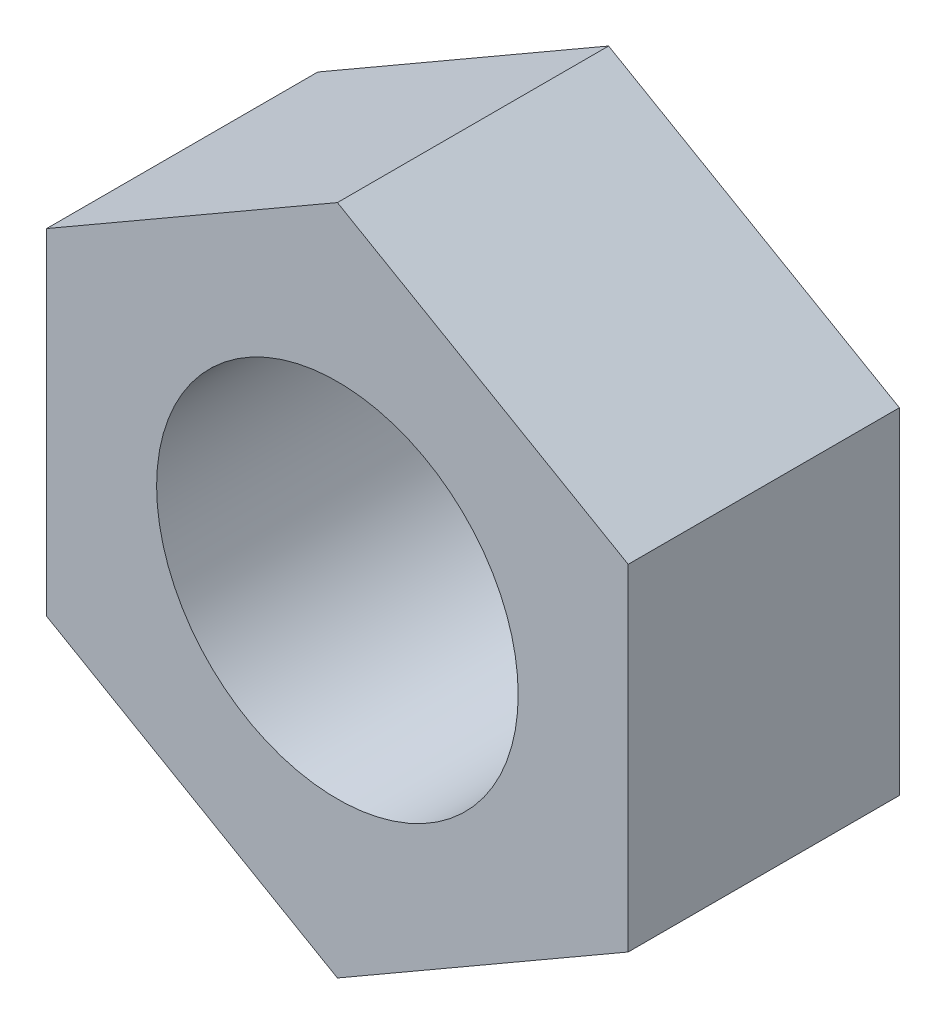
ISO-10303-21;
HEADER;
FILE_DESCRIPTION(('STEP AP214'),'2;1');
FILE_NAME('part.step','',(''),(''),'','','');
FILE_SCHEMA(('AUTOMOTIVE_DESIGN { 1 0 10303 214 1 1 1 1 }'));
ENDSEC;
DATA;
#1=APPLICATION_CONTEXT('core data for automotive mechanical design processes');
#2=APPLICATION_PROTOCOL_DEFINITION('international standard','automotive_design',2000,#1);
#3=PRODUCT_CONTEXT('',#1,'mechanical');
#4=PRODUCT('Part','Part','',(#3));
#5=PRODUCT_RELATED_PRODUCT_CATEGORY('part','',(#4));
#6=PRODUCT_DEFINITION_FORMATION('','',#4);
#7=PRODUCT_DEFINITION_CONTEXT('part definition',#1,'design');
#8=PRODUCT_DEFINITION('design','',#6,#7);
#9=PRODUCT_DEFINITION_SHAPE('','',#8);
#10=(LENGTH_UNIT() NAMED_UNIT(*) SI_UNIT(.MILLI.,.METRE.));
#11=(NAMED_UNIT(*) PLANE_ANGLE_UNIT() SI_UNIT($,.RADIAN.));
#12=(NAMED_UNIT(*) SI_UNIT($,.STERADIAN.) SOLID_ANGLE_UNIT());
#13=UNCERTAINTY_MEASURE_WITH_UNIT(LENGTH_MEASURE(1.E-05),#10,'distance_accuracy_value','');
#14=(GEOMETRIC_REPRESENTATION_CONTEXT(3) GLOBAL_UNCERTAINTY_ASSIGNED_CONTEXT((#13)) GLOBAL_UNIT_ASSIGNED_CONTEXT((#10,
#11,#12)) REPRESENTATION_CONTEXT('',''));
#15=CARTESIAN_POINT('',(0.,0.,0.));
#16=DIRECTION('',(0.,0.,1.));
#17=DIRECTION('',(1.,0.,0.));
#18=AXIS2_PLACEMENT_3D('',#15,#16,#17);
#19=CARTESIAN_POINT('',(0.,0.,4.5));
#20=DIRECTION('',(0.,0.,1.));
#21=DIRECTION('',(1.,0.,0.));
#22=AXIS2_PLACEMENT_3D('',#19,#20,#21);
#23=PLANE('',#22);
#24=DIRECTION('',(-0.866025403784439,0.5,0.));
#25=VECTOR('',#24,1.);
#26=CARTESIAN_POINT('',(9.65,5.57143009767989,4.5));
#27=LINE('',#26,#25);
#28=CARTESIAN_POINT('',(9.65,5.57143009767989,4.5));
#29=VERTEX_POINT('',#28);
#30=CARTESIAN_POINT('',(0.,11.1428601953598,4.5));
#31=VERTEX_POINT('',#30);
#32=EDGE_CURVE('E129',#29,#31,#27,.T.);
#33=ORIENTED_EDGE('',*,*,#32,.T.);
#34=DIRECTION('',(-0.866025403784439,-0.5,0.));
#35=VECTOR('',#34,1.);
#36=CARTESIAN_POINT('',(0.,11.1428601953598,4.5));
#37=LINE('',#36,#35);
#38=CARTESIAN_POINT('',(-9.65,5.57143009767988,4.5));
#39=VERTEX_POINT('',#38);
#40=EDGE_CURVE('E87',#31,#39,#37,.T.);
#41=ORIENTED_EDGE('',*,*,#40,.T.);
#42=DIRECTION('',(0.,-1.,0.));
#43=VECTOR('',#42,1.);
#44=CARTESIAN_POINT('',(-9.65,5.57143009767988,4.5));
#45=LINE('',#44,#43);
#46=CARTESIAN_POINT('',(-9.65,-5.57143009767989,4.5));
#47=VERTEX_POINT('',#46);
#48=EDGE_CURVE('E100',#39,#47,#45,.T.);
#49=ORIENTED_EDGE('',*,*,#48,.T.);
#50=DIRECTION('',(0.866025403784439,-0.5,0.));
#51=VECTOR('',#50,1.);
#52=CARTESIAN_POINT('',(-9.65,-5.57143009767989,4.5));
#53=LINE('',#52,#51);
#54=CARTESIAN_POINT('',(0.,-11.1428601953598,4.5));
#55=VERTEX_POINT('',#54);
#56=EDGE_CURVE('E94',#47,#55,#53,.T.);
#57=ORIENTED_EDGE('',*,*,#56,.T.);
#58=DIRECTION('',(0.866025403784439,0.5,0.));
#59=VECTOR('',#58,1.);
#60=CARTESIAN_POINT('',(0.,-11.1428601953598,4.5));
#61=LINE('',#60,#59);
#62=CARTESIAN_POINT('',(9.65,-5.57143009767988,4.5));
#63=VERTEX_POINT('',#62);
#64=EDGE_CURVE('E98',#55,#63,#61,.T.);
#65=ORIENTED_EDGE('',*,*,#64,.T.);
#66=DIRECTION('',(0.,1.,0.));
#67=VECTOR('',#66,1.);
#68=CARTESIAN_POINT('',(9.65,-5.57143009767988,4.5));
#69=LINE('',#68,#67);
#70=EDGE_CURVE('E50',#63,#29,#69,.T.);
#71=ORIENTED_EDGE('',*,*,#70,.T.);
#72=EDGE_LOOP('',(#33,#41,#49,#57,#65,#71));
#73=FACE_BOUND('',#72,.T.);
#74=CARTESIAN_POINT('',(0.,0.,4.5));
#75=DIRECTION('',(0.,0.,1.));
#76=DIRECTION('',(1.,0.,0.));
#77=AXIS2_PLACEMENT_3D('',#74,#75,#76);
#78=CIRCLE('',#77,6.);
#79=CARTESIAN_POINT('',(6.,0.,4.5));
#80=VERTEX_POINT('',#79);
#81=EDGE_CURVE('E122',#80,#80,#78,.T.);
#82=ORIENTED_EDGE('',*,*,#81,.F.);
#83=EDGE_LOOP('',(#82));
#84=FACE_BOUND('',#83,.T.);
#85=ADVANCED_FACE('F33',(#73,#84),#23,.T.);
#86=CARTESIAN_POINT('',(0.,0.,-4.5));
#87=DIRECTION('',(0.,0.,1.));
#88=DIRECTION('',(1.,0.,0.));
#89=AXIS2_PLACEMENT_3D('',#86,#87,#88);
#90=PLANE('',#89);
#91=DIRECTION('',(-0.866025403784439,0.5,0.));
#92=VECTOR('',#91,1.);
#93=CARTESIAN_POINT('',(9.65,5.57143009767989,-4.5));
#94=LINE('',#93,#92);
#95=CARTESIAN_POINT('',(9.65,5.57143009767989,-4.5));
#96=VERTEX_POINT('',#95);
#97=CARTESIAN_POINT('',(0.,11.1428601953598,-4.5));
#98=VERTEX_POINT('',#97);
#99=EDGE_CURVE('E118',#96,#98,#94,.T.);
#100=ORIENTED_EDGE('',*,*,#99,.F.);
#101=DIRECTION('',(0.,1.,0.));
#102=VECTOR('',#101,1.);
#103=CARTESIAN_POINT('',(9.65,-5.57143009767988,-4.5));
#104=LINE('',#103,#102);
#105=CARTESIAN_POINT('',(9.65,-5.57143009767988,-4.5));
#106=VERTEX_POINT('',#105);
#107=EDGE_CURVE('E79',#106,#96,#104,.T.);
#108=ORIENTED_EDGE('',*,*,#107,.F.);
#109=DIRECTION('',(0.866025403784439,0.5,0.));
#110=VECTOR('',#109,1.);
#111=CARTESIAN_POINT('',(0.,-11.1428601953598,-4.5));
#112=LINE('',#111,#110);
#113=CARTESIAN_POINT('',(0.,-11.1428601953598,-4.5));
#114=VERTEX_POINT('',#113);
#115=EDGE_CURVE('E73',#114,#106,#112,.T.);
#116=ORIENTED_EDGE('',*,*,#115,.F.);
#117=DIRECTION('',(0.866025403784439,-0.5,0.));
#118=VECTOR('',#117,1.);
#119=CARTESIAN_POINT('',(-9.65,-5.57143009767989,-4.5));
#120=LINE('',#119,#118);
#121=CARTESIAN_POINT('',(-9.65,-5.57143009767989,-4.5));
#122=VERTEX_POINT('',#121);
#123=EDGE_CURVE('E108',#122,#114,#120,.T.);
#124=ORIENTED_EDGE('',*,*,#123,.F.);
#125=DIRECTION('',(0.,-1.,0.));
#126=VECTOR('',#125,1.);
#127=CARTESIAN_POINT('',(-9.65,5.57143009767988,-4.5));
#128=LINE('',#127,#126);
#129=CARTESIAN_POINT('',(-9.65,5.57143009767988,-4.5));
#130=VERTEX_POINT('',#129);
#131=EDGE_CURVE('E124',#130,#122,#128,.T.);
#132=ORIENTED_EDGE('',*,*,#131,.F.);
#133=DIRECTION('',(-0.866025403784439,-0.5,0.));
#134=VECTOR('',#133,1.);
#135=CARTESIAN_POINT('',(0.,11.1428601953598,-4.5));
#136=LINE('',#135,#134);
#137=EDGE_CURVE('E121',#98,#130,#136,.T.);
#138=ORIENTED_EDGE('',*,*,#137,.F.);
#139=EDGE_LOOP('',(#100,#108,#116,#124,#132,#138));
#140=FACE_BOUND('',#139,.T.);
#141=CARTESIAN_POINT('',(0.,0.,-4.5));
#142=DIRECTION('',(0.,0.,1.));
#143=DIRECTION('',(1.,0.,0.));
#144=AXIS2_PLACEMENT_3D('',#141,#142,#143);
#145=CIRCLE('',#144,6.);
#146=CARTESIAN_POINT('',(6.,0.,-4.5));
#147=VERTEX_POINT('',#146);
#148=EDGE_CURVE('E222',#147,#147,#145,.T.);
#149=ORIENTED_EDGE('',*,*,#148,.T.);
#150=EDGE_LOOP('',(#149));
#151=FACE_BOUND('',#150,.T.);
#152=ADVANCED_FACE('F138',(#140,#151),#90,.F.);
#153=CARTESIAN_POINT('',(9.65,5.57143009767989,4.5));
#154=DIRECTION('',(-0.5,-0.866025403784439,0.));
#155=DIRECTION('',(0.866025403784439,-0.5,0.));
#156=AXIS2_PLACEMENT_3D('',#153,#154,#155);
#157=PLANE('',#156);
#158=ORIENTED_EDGE('',*,*,#99,.T.);
#159=DIRECTION('',(0.,0.,-1.));
#160=VECTOR('',#159,1.);
#161=CARTESIAN_POINT('',(0.,11.1428601953598,4.5));
#162=LINE('',#161,#160);
#163=EDGE_CURVE('E11',#31,#98,#162,.T.);
#164=ORIENTED_EDGE('',*,*,#163,.F.);
#165=ORIENTED_EDGE('',*,*,#32,.F.);
#166=DIRECTION('',(0.,0.,-1.));
#167=VECTOR('',#166,1.);
#168=CARTESIAN_POINT('',(9.65,5.57143009767989,4.5));
#169=LINE('',#168,#167);
#170=EDGE_CURVE('E114',#29,#96,#169,.T.);
#171=ORIENTED_EDGE('',*,*,#170,.T.);
#172=EDGE_LOOP('',(#158,#164,#165,#171));
#173=FACE_BOUND('',#172,.T.);
#174=ADVANCED_FACE('F35',(#173),#157,.F.);
#175=CARTESIAN_POINT('',(0.,11.1428601953598,4.5));
#176=DIRECTION('',(0.5,-0.866025403784439,0.));
#177=DIRECTION('',(0.866025403784439,0.5,0.));
#178=AXIS2_PLACEMENT_3D('',#175,#176,#177);
#179=PLANE('',#178);
#180=ORIENTED_EDGE('',*,*,#137,.T.);
#181=DIRECTION('',(0.,0.,-1.));
#182=VECTOR('',#181,1.);
#183=CARTESIAN_POINT('',(-9.65,5.57143009767988,4.5));
#184=LINE('',#183,#182);
#185=EDGE_CURVE('E42',#39,#130,#184,.T.);
#186=ORIENTED_EDGE('',*,*,#185,.F.);
#187=ORIENTED_EDGE('',*,*,#40,.F.);
#188=ORIENTED_EDGE('',*,*,#163,.T.);
#189=EDGE_LOOP('',(#180,#186,#187,#188));
#190=FACE_BOUND('',#189,.T.);
#191=ADVANCED_FACE('F163',(#190),#179,.F.);
#192=CARTESIAN_POINT('',(-9.65,5.57143009767988,4.5));
#193=DIRECTION('',(1.,0.,0.));
#194=DIRECTION('',(0.,1.,0.));
#195=AXIS2_PLACEMENT_3D('',#192,#193,#194);
#196=PLANE('',#195);
#197=ORIENTED_EDGE('',*,*,#131,.T.);
#198=DIRECTION('',(0.,0.,-1.));
#199=VECTOR('',#198,1.);
#200=CARTESIAN_POINT('',(-9.65,-5.57143009767989,4.5));
#201=LINE('',#200,#199);
#202=EDGE_CURVE('E109',#47,#122,#201,.T.);
#203=ORIENTED_EDGE('',*,*,#202,.F.);
#204=ORIENTED_EDGE('',*,*,#48,.F.);
#205=ORIENTED_EDGE('',*,*,#185,.T.);
#206=EDGE_LOOP('',(#197,#203,#204,#205));
#207=FACE_BOUND('',#206,.T.);
#208=ADVANCED_FACE('F135',(#207),#196,.F.);
#209=CARTESIAN_POINT('',(-9.65,-5.57143009767989,4.5));
#210=DIRECTION('',(0.5,0.866025403784439,0.));
#211=DIRECTION('',(-0.866025403784439,0.5,0.));
#212=AXIS2_PLACEMENT_3D('',#209,#210,#211);
#213=PLANE('',#212);
#214=ORIENTED_EDGE('',*,*,#123,.T.);
#215=DIRECTION('',(0.,0.,-1.));
#216=VECTOR('',#215,1.);
#217=CARTESIAN_POINT('',(0.,-11.1428601953598,4.5));
#218=LINE('',#217,#216);
#219=EDGE_CURVE('E105',#55,#114,#218,.T.);
#220=ORIENTED_EDGE('',*,*,#219,.F.);
#221=ORIENTED_EDGE('',*,*,#56,.F.);
#222=ORIENTED_EDGE('',*,*,#202,.T.);
#223=EDGE_LOOP('',(#214,#220,#221,#222));
#224=FACE_BOUND('',#223,.T.);
#225=ADVANCED_FACE('F106',(#224),#213,.F.);
#226=CARTESIAN_POINT('',(0.,-11.1428601953598,4.5));
#227=DIRECTION('',(-0.5,0.866025403784439,0.));
#228=DIRECTION('',(-0.866025403784439,-0.5,0.));
#229=AXIS2_PLACEMENT_3D('',#226,#227,#228);
#230=PLANE('',#229);
#231=ORIENTED_EDGE('',*,*,#115,.T.);
#232=DIRECTION('',(0.,0.,-1.));
#233=VECTOR('',#232,1.);
#234=CARTESIAN_POINT('',(9.65,-5.57143009767988,4.5));
#235=LINE('',#234,#233);
#236=EDGE_CURVE('E110',#63,#106,#235,.T.);
#237=ORIENTED_EDGE('',*,*,#236,.F.);
#238=ORIENTED_EDGE('',*,*,#64,.F.);
#239=ORIENTED_EDGE('',*,*,#219,.T.);
#240=EDGE_LOOP('',(#231,#237,#238,#239));
#241=FACE_BOUND('',#240,.T.);
#242=ADVANCED_FACE('F112',(#241),#230,.F.);
#243=CARTESIAN_POINT('',(9.65,-5.57143009767988,4.5));
#244=DIRECTION('',(-1.,0.,0.));
#245=DIRECTION('',(0.,0.,1.));
#246=AXIS2_PLACEMENT_3D('',#243,#244,#245);
#247=PLANE('',#246);
#248=ORIENTED_EDGE('',*,*,#107,.T.);
#249=ORIENTED_EDGE('',*,*,#170,.F.);
#250=ORIENTED_EDGE('',*,*,#70,.F.);
#251=ORIENTED_EDGE('',*,*,#236,.T.);
#252=EDGE_LOOP('',(#248,#249,#250,#251));
#253=FACE_BOUND('',#252,.T.);
#254=ADVANCED_FACE('F143',(#253),#247,.F.);
#255=CARTESIAN_POINT('',(0.,0.,4.5));
#256=DIRECTION('',(0.,0.,-1.));
#257=DIRECTION('',(-1.,0.,0.));
#258=AXIS2_PLACEMENT_3D('',#255,#256,#257);
#259=CYLINDRICAL_SURFACE('',#258,6.);
#260=ORIENTED_EDGE('',*,*,#81,.T.);
#261=EDGE_LOOP('',(#260));
#262=FACE_BOUND('',#261,.T.);
#263=ORIENTED_EDGE('',*,*,#148,.F.);
#264=EDGE_LOOP('',(#263));
#265=FACE_BOUND('',#264,.T.);
#266=ADVANCED_FACE('F145',(#262,#265),#259,.F.);
#267=CLOSED_SHELL('',(#85,#152,#174,#191,#208,#225,#242,#254,#266));
#268=MANIFOLD_SOLID_BREP('B2',#267);
#269=ADVANCED_BREP_SHAPE_REPRESENTATION('',(#18,#268),#14);
#270=SHAPE_DEFINITION_REPRESENTATION(#9,#269);
ENDSEC;
END-ISO-10303-21;
